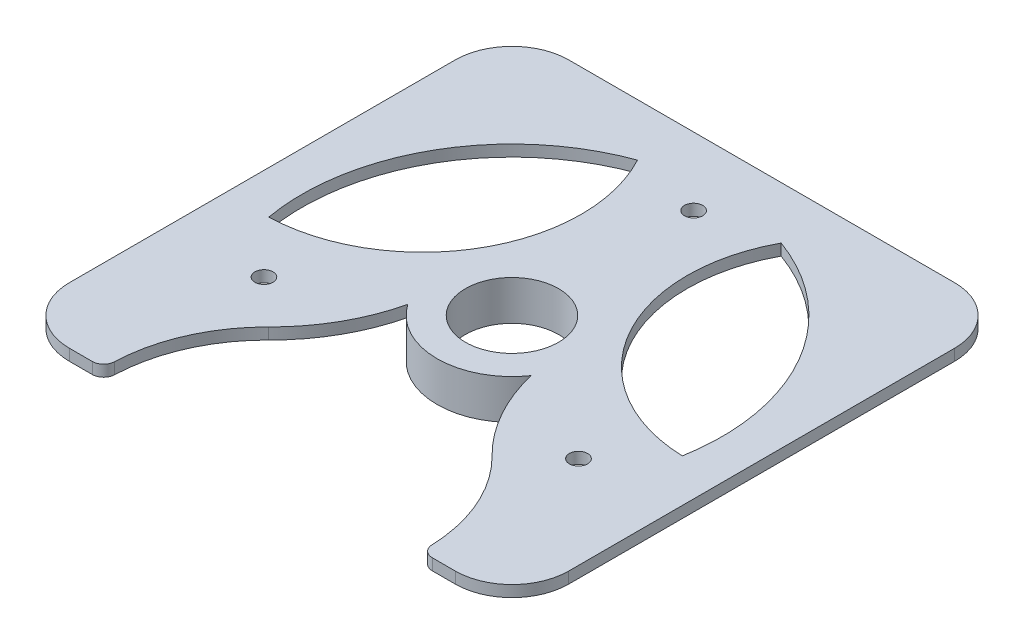
ISO-10303-21;
HEADER;
FILE_DESCRIPTION(('STEP AP214'),'2;1');
FILE_NAME('part.step','',(''),(''),'','','');
FILE_SCHEMA(('AUTOMOTIVE_DESIGN { 1 0 10303 214 1 1 1 1 }'));
ENDSEC;
DATA;
#1=APPLICATION_CONTEXT('core data for automotive mechanical design processes');
#2=APPLICATION_PROTOCOL_DEFINITION('international standard','automotive_design',2000,#1);
#3=PRODUCT_CONTEXT('',#1,'mechanical');
#4=PRODUCT('Part','Part','',(#3));
#5=PRODUCT_RELATED_PRODUCT_CATEGORY('part','',(#4));
#6=PRODUCT_DEFINITION_FORMATION('','',#4);
#7=PRODUCT_DEFINITION_CONTEXT('part definition',#1,'design');
#8=PRODUCT_DEFINITION('design','',#6,#7);
#9=PRODUCT_DEFINITION_SHAPE('','',#8);
#10=(LENGTH_UNIT() NAMED_UNIT(*) SI_UNIT(.MILLI.,.METRE.));
#11=(NAMED_UNIT(*) PLANE_ANGLE_UNIT() SI_UNIT($,.RADIAN.));
#12=(NAMED_UNIT(*) SI_UNIT($,.STERADIAN.) SOLID_ANGLE_UNIT());
#13=UNCERTAINTY_MEASURE_WITH_UNIT(LENGTH_MEASURE(1.E-05),#10,'distance_accuracy_value','');
#14=(GEOMETRIC_REPRESENTATION_CONTEXT(3) GLOBAL_UNCERTAINTY_ASSIGNED_CONTEXT((#13)) GLOBAL_UNIT_ASSIGNED_CONTEXT((#10,
#11,#12)) REPRESENTATION_CONTEXT('',''));
#15=CARTESIAN_POINT('',(0.,0.,0.));
#16=DIRECTION('',(0.,0.,1.));
#17=DIRECTION('',(1.,0.,0.));
#18=AXIS2_PLACEMENT_3D('',#15,#16,#17);
#19=CARTESIAN_POINT('',(0.,2.,0.));
#20=DIRECTION('',(0.,-1.,0.));
#21=DIRECTION('',(0.,0.,-1.));
#22=AXIS2_PLACEMENT_3D('',#19,#20,#21);
#23=PLANE('',#22);
#24=CARTESIAN_POINT('',(27.712812921102,2.,16.0000000000001));
#25=DIRECTION('',(0.,-1.,0.));
#26=DIRECTION('',(0.866025403784436,0.,0.500000000000004));
#27=AXIS2_PLACEMENT_3D('',#24,#25,#26);
#28=CIRCLE('',#27,1.6);
#29=CARTESIAN_POINT('',(29.0984535671571,2.,16.8000000000001));
#30=VERTEX_POINT('',#29);
#31=EDGE_CURVE('E695',#30,#30,#28,.T.);
#32=ORIENTED_EDGE('',*,*,#31,.T.);
#33=EDGE_LOOP('',(#32));
#34=FACE_BOUND('',#33,.T.);
#35=CARTESIAN_POINT('',(-27.7128129211022,2.,15.9999999999997));
#36=DIRECTION('',(0.,-1.,0.));
#37=DIRECTION('',(-0.866025403784443,0.,0.499999999999992));
#38=AXIS2_PLACEMENT_3D('',#35,#36,#37);
#39=CIRCLE('',#38,1.6);
#40=CARTESIAN_POINT('',(-29.0984535671573,2.,16.7999999999997));
#41=VERTEX_POINT('',#40);
#42=EDGE_CURVE('E699',#41,#41,#39,.T.);
#43=ORIENTED_EDGE('',*,*,#42,.T.);
#44=EDGE_LOOP('',(#43));
#45=FACE_BOUND('',#44,.T.);
#46=CARTESIAN_POINT('',(0.,2.,-32.));
#47=DIRECTION('',(0.,-1.,0.));
#48=DIRECTION('',(0.,0.,-1.));
#49=AXIS2_PLACEMENT_3D('',#46,#47,#48);
#50=CIRCLE('',#49,1.6);
#51=CARTESIAN_POINT('',(0.,2.,-33.6));
#52=VERTEX_POINT('',#51);
#53=EDGE_CURVE('E709',#52,#52,#50,.T.);
#54=ORIENTED_EDGE('',*,*,#53,.T.);
#55=EDGE_LOOP('',(#54));
#56=FACE_BOUND('',#55,.T.);
#57=CARTESIAN_POINT('',(-37.3070238699556,2.,-21.5392202739826));
#58=DIRECTION('',(0.,1.,0.));
#59=DIRECTION('',(0.866025403784436,0.,-0.500000000000004));
#60=AXIS2_PLACEMENT_3D('',#57,#58,#59);
#61=CIRCLE('',#60,27.9777061254953);
#62=CARTESIAN_POINT('',(-36.4378868614517,2.,6.42498257367656));
#63=VERTEX_POINT('',#62);
#64=CARTESIAN_POINT('',(-12.6547453030497,2.,-34.7686269690786));
#65=VERTEX_POINT('',#64);
#66=EDGE_CURVE('E414',#63,#65,#61,.T.);
#67=ORIENTED_EDGE('',*,*,#66,.F.);
#68=CARTESIAN_POINT('',(0.,2.,0.));
#69=DIRECTION('',(0.,1.,0.));
#70=DIRECTION('',(0.866025403784436,0.,-0.500000000000004));
#71=AXIS2_PLACEMENT_3D('',#68,#69,#70);
#72=CIRCLE('',#71,37.);
#73=EDGE_CURVE('E197',#65,#63,#72,.T.);
#74=ORIENTED_EDGE('',*,*,#73,.F.);
#75=EDGE_LOOP('',(#67,#74));
#76=FACE_BOUND('',#75,.T.);
#77=CARTESIAN_POINT('',(37.3070238699556,2.,-21.5392202739825));
#78=DIRECTION('',(0.,1.,0.));
#79=DIRECTION('',(0.,0.,1.));
#80=AXIS2_PLACEMENT_3D('',#77,#78,#79);
#81=CIRCLE('',#80,27.9777061254953);
#82=CARTESIAN_POINT('',(12.6547453030498,2.,-34.7686269690786));
#83=VERTEX_POINT('',#82);
#84=CARTESIAN_POINT('',(36.4378868614517,2.,6.42498257367663));
#85=VERTEX_POINT('',#84);
#86=EDGE_CURVE('E208',#83,#85,#81,.T.);
#87=ORIENTED_EDGE('',*,*,#86,.F.);
#88=CARTESIAN_POINT('',(0.,2.,0.));
#89=DIRECTION('',(0.,1.,0.));
#90=DIRECTION('',(0.,0.,1.));
#91=AXIS2_PLACEMENT_3D('',#88,#89,#90);
#92=CIRCLE('',#91,37.);
#93=EDGE_CURVE('E212',#85,#83,#92,.T.);
#94=ORIENTED_EDGE('',*,*,#93,.F.);
#95=EDGE_LOOP('',(#87,#94));
#96=FACE_BOUND('',#95,.T.);
#97=CARTESIAN_POINT('',(-42.6237394195835,2.,0.));
#98=DIRECTION('',(0.,-1.,0.));
#99=DIRECTION('',(0.,0.,-1.));
#100=AXIS2_PLACEMENT_3D('',#97,#98,#99);
#101=CIRCLE('',#100,32.6237394195835);
#102=CARTESIAN_POINT('',(-10.8708761949437,2.,7.48759312157157));
#103=VERTEX_POINT('',#102);
#104=CARTESIAN_POINT('',(-19.6779869642504,2.,23.1905329385821));
#105=VERTEX_POINT('',#104);
#106=EDGE_CURVE('E186',#103,#105,#101,.T.);
#107=ORIENTED_EDGE('',*,*,#106,.F.);
#108=CARTESIAN_POINT('',(0.,2.,0.));
#109=DIRECTION('',(0.,-1.,0.));
#110=DIRECTION('',(0.,0.,-1.));
#111=AXIS2_PLACEMENT_3D('',#108,#109,#110);
#112=CIRCLE('',#111,13.2);
#113=CARTESIAN_POINT('',(10.8708761949437,2.,7.48759312157157));
#114=VERTEX_POINT('',#113);
#115=EDGE_CURVE('E402',#103,#114,#112,.F.);
#116=ORIENTED_EDGE('',*,*,#115,.T.);
#117=CARTESIAN_POINT('',(42.6237394195835,2.,0.));
#118=DIRECTION('',(0.,-1.,0.));
#119=DIRECTION('',(0.,0.,1.));
#120=AXIS2_PLACEMENT_3D('',#117,#118,#119);
#121=CIRCLE('',#120,32.6237394195835);
#122=CARTESIAN_POINT('',(19.6779869642505,2.,23.190532938582));
#123=VERTEX_POINT('',#122);
#124=EDGE_CURVE('E181',#123,#114,#121,.T.);
#125=ORIENTED_EDGE('',*,*,#124,.F.);
#126=CARTESIAN_POINT('',(2.63677968348475E-13,2.,43.0784405479653));
#127=DIRECTION('',(0.,1.,0.));
#128=DIRECTION('',(-0.866025403784443,0.,-0.499999999999992));
#129=AXIS2_PLACEMENT_3D('',#126,#127,#128);
#130=CIRCLE('',#129,27.9777061254953);
#131=CARTESIAN_POINT('',(27.9595961312682,2.,42.071949504305));
#132=VERTEX_POINT('',#131);
#133=EDGE_CURVE('E195',#132,#123,#130,.T.);
#134=ORIENTED_EDGE('',*,*,#133,.F.);
#135=CARTESIAN_POINT('',(29.9583015294773,2.,42.));
#136=DIRECTION('',(0.,-1.,0.));
#137=DIRECTION('',(0.,0.,-1.));
#138=AXIS2_PLACEMENT_3D('',#135,#136,#137);
#139=CIRCLE('',#138,2.);
#140=CARTESIAN_POINT('',(29.9583015294773,2.,44.));
#141=VERTEX_POINT('',#140);
#142=EDGE_CURVE('E296',#132,#141,#139,.F.);
#143=ORIENTED_EDGE('',*,*,#142,.T.);
#144=DIRECTION('',(1.,0.,0.));
#145=VECTOR('',#144,1.);
#146=CARTESIAN_POINT('',(-44.,2.,44.));
#147=LINE('',#146,#145);
#148=CARTESIAN_POINT('',(34.,2.,44.));
#149=VERTEX_POINT('',#148);
#150=EDGE_CURVE('E232',#141,#149,#147,.T.);
#151=ORIENTED_EDGE('',*,*,#150,.T.);
#152=CARTESIAN_POINT('',(34.,2.,34.));
#153=DIRECTION('',(0.,-1.,0.));
#154=DIRECTION('',(0.,0.,-1.));
#155=AXIS2_PLACEMENT_3D('',#152,#153,#154);
#156=CIRCLE('',#155,10.);
#157=CARTESIAN_POINT('',(44.,2.,34.));
#158=VERTEX_POINT('',#157);
#159=EDGE_CURVE('E273',#149,#158,#156,.F.);
#160=ORIENTED_EDGE('',*,*,#159,.T.);
#161=DIRECTION('',(0.,0.,-1.));
#162=VECTOR('',#161,1.);
#163=CARTESIAN_POINT('',(44.,2.,44.));
#164=LINE('',#163,#162);
#165=CARTESIAN_POINT('',(44.,2.,-34.));
#166=VERTEX_POINT('',#165);
#167=EDGE_CURVE('E222',#158,#166,#164,.T.);
#168=ORIENTED_EDGE('',*,*,#167,.T.);
#169=CARTESIAN_POINT('',(34.,2.,-34.));
#170=DIRECTION('',(0.,-1.,0.));
#171=DIRECTION('',(0.,0.,-1.));
#172=AXIS2_PLACEMENT_3D('',#169,#170,#171);
#173=CIRCLE('',#172,10.);
#174=CARTESIAN_POINT('',(34.,2.,-44.));
#175=VERTEX_POINT('',#174);
#176=EDGE_CURVE('E269',#166,#175,#173,.F.);
#177=ORIENTED_EDGE('',*,*,#176,.T.);
#178=DIRECTION('',(-1.,0.,0.));
#179=VECTOR('',#178,1.);
#180=CARTESIAN_POINT('',(-44.,2.,-44.));
#181=LINE('',#180,#179);
#182=CARTESIAN_POINT('',(-34.,2.,-44.));
#183=VERTEX_POINT('',#182);
#184=EDGE_CURVE('E225',#175,#183,#181,.T.);
#185=ORIENTED_EDGE('',*,*,#184,.T.);
#186=CARTESIAN_POINT('',(-34.,2.,-34.));
#187=DIRECTION('',(0.,-1.,0.));
#188=DIRECTION('',(0.,0.,-1.));
#189=AXIS2_PLACEMENT_3D('',#186,#187,#188);
#190=CIRCLE('',#189,10.);
#191=CARTESIAN_POINT('',(-44.,2.,-34.));
#192=VERTEX_POINT('',#191);
#193=EDGE_CURVE('E267',#183,#192,#190,.F.);
#194=ORIENTED_EDGE('',*,*,#193,.T.);
#195=DIRECTION('',(0.,0.,1.));
#196=VECTOR('',#195,1.);
#197=CARTESIAN_POINT('',(-44.,2.,44.));
#198=LINE('',#197,#196);
#199=CARTESIAN_POINT('',(-44.,2.,34.));
#200=VERTEX_POINT('',#199);
#201=EDGE_CURVE('E229',#192,#200,#198,.T.);
#202=ORIENTED_EDGE('',*,*,#201,.T.);
#203=CARTESIAN_POINT('',(-34.,2.,34.));
#204=DIRECTION('',(0.,-1.,0.));
#205=DIRECTION('',(0.,0.,-1.));
#206=AXIS2_PLACEMENT_3D('',#203,#204,#205);
#207=CIRCLE('',#206,10.);
#208=CARTESIAN_POINT('',(-34.,2.,44.));
#209=VERTEX_POINT('',#208);
#210=EDGE_CURVE('E271',#200,#209,#207,.F.);
#211=ORIENTED_EDGE('',*,*,#210,.T.);
#212=CARTESIAN_POINT('',(-29.9583015294768,2.,44.));
#213=VERTEX_POINT('',#212);
#214=EDGE_CURVE('E233',#209,#213,#147,.T.);
#215=ORIENTED_EDGE('',*,*,#214,.T.);
#216=CARTESIAN_POINT('',(-29.9583015294768,2.,42.));
#217=DIRECTION('',(0.,-1.,0.));
#218=DIRECTION('',(0.,0.,-1.));
#219=AXIS2_PLACEMENT_3D('',#216,#217,#218);
#220=CIRCLE('',#219,2.);
#221=CARTESIAN_POINT('',(-27.9595961312676,2.,42.071949504305));
#222=VERTEX_POINT('',#221);
#223=EDGE_CURVE('E294',#213,#222,#220,.F.);
#224=ORIENTED_EDGE('',*,*,#223,.T.);
#225=EDGE_CURVE('E198',#105,#222,#130,.T.);
#226=ORIENTED_EDGE('',*,*,#225,.F.);
#227=EDGE_LOOP('',(#107,#116,#125,#134,#143,#151,#160,#168,#177,#185,#194,#202,#211,#215,#224,#226));
#228=FACE_BOUND('',#227,.T.);
#229=CARTESIAN_POINT('',(0.,2.,0.));
#230=DIRECTION('',(0.,-1.,0.));
#231=DIRECTION('',(0.,0.,-1.));
#232=AXIS2_PLACEMENT_3D('',#229,#230,#231);
#233=CIRCLE('',#232,8.2);
#234=CARTESIAN_POINT('',(0.,2.,-8.2));
#235=VERTEX_POINT('',#234);
#236=EDGE_CURVE('E720',#235,#235,#233,.F.);
#237=ORIENTED_EDGE('',*,*,#236,.F.);
#238=EDGE_LOOP('',(#237));
#239=FACE_BOUND('',#238,.T.);
#240=ADVANCED_FACE('F38',(#34,#45,#56,#76,#96,#228,#239),#23,.F.);
#241=CARTESIAN_POINT('',(0.,0.,0.));
#242=DIRECTION('',(0.,-1.,0.));
#243=DIRECTION('',(0.,0.,-1.));
#244=AXIS2_PLACEMENT_3D('',#241,#242,#243);
#245=PLANE('',#244);
#246=CARTESIAN_POINT('',(27.712812921102,0.,16.0000000000001));
#247=DIRECTION('',(0.,-1.,0.));
#248=DIRECTION('',(0.866025403784436,0.,0.500000000000004));
#249=AXIS2_PLACEMENT_3D('',#246,#247,#248);
#250=CIRCLE('',#249,1.6);
#251=CARTESIAN_POINT('',(29.0984535671571,0.,16.8000000000001));
#252=VERTEX_POINT('',#251);
#253=EDGE_CURVE('E698',#252,#252,#250,.T.);
#254=ORIENTED_EDGE('',*,*,#253,.F.);
#255=EDGE_LOOP('',(#254));
#256=FACE_BOUND('',#255,.T.);
#257=CARTESIAN_POINT('',(-27.7128129211022,0.,15.9999999999997));
#258=DIRECTION('',(0.,-1.,0.));
#259=DIRECTION('',(-0.866025403784443,0.,0.499999999999992));
#260=AXIS2_PLACEMENT_3D('',#257,#258,#259);
#261=CIRCLE('',#260,1.6);
#262=CARTESIAN_POINT('',(-29.0984535671573,0.,16.7999999999997));
#263=VERTEX_POINT('',#262);
#264=EDGE_CURVE('E704',#263,#263,#261,.T.);
#265=ORIENTED_EDGE('',*,*,#264,.F.);
#266=EDGE_LOOP('',(#265));
#267=FACE_BOUND('',#266,.T.);
#268=CARTESIAN_POINT('',(0.,0.,-32.));
#269=DIRECTION('',(0.,-1.,0.));
#270=DIRECTION('',(0.,0.,-1.));
#271=AXIS2_PLACEMENT_3D('',#268,#269,#270);
#272=CIRCLE('',#271,1.6);
#273=CARTESIAN_POINT('',(0.,0.,-33.6));
#274=VERTEX_POINT('',#273);
#275=EDGE_CURVE('E701',#274,#274,#272,.T.);
#276=ORIENTED_EDGE('',*,*,#275,.F.);
#277=EDGE_LOOP('',(#276));
#278=FACE_BOUND('',#277,.T.);
#279=CARTESIAN_POINT('',(0.,0.,0.));
#280=DIRECTION('',(0.,-1.,0.));
#281=DIRECTION('',(0.,0.,-1.));
#282=AXIS2_PLACEMENT_3D('',#279,#280,#281);
#283=CIRCLE('',#282,13.2);
#284=CARTESIAN_POINT('',(-10.8708761949437,0.,7.48759312157157));
#285=VERTEX_POINT('',#284);
#286=CARTESIAN_POINT('',(10.8708761949437,0.,7.48759312157157));
#287=VERTEX_POINT('',#286);
#288=EDGE_CURVE('E53',#285,#287,#283,.T.);
#289=ORIENTED_EDGE('',*,*,#288,.F.);
#290=CARTESIAN_POINT('',(-42.6237394195835,0.,0.));
#291=DIRECTION('',(0.,-1.,0.));
#292=DIRECTION('',(0.,0.,-1.));
#293=AXIS2_PLACEMENT_3D('',#290,#291,#292);
#294=CIRCLE('',#293,32.6237394195835);
#295=CARTESIAN_POINT('',(-19.6779869642504,0.,23.1905329385821));
#296=VERTEX_POINT('',#295);
#297=EDGE_CURVE('E173',#285,#296,#294,.T.);
#298=ORIENTED_EDGE('',*,*,#297,.T.);
#299=CARTESIAN_POINT('',(2.63677968348475E-13,0.,43.0784405479653));
#300=DIRECTION('',(0.,1.,0.));
#301=DIRECTION('',(-0.866025403784443,0.,-0.499999999999992));
#302=AXIS2_PLACEMENT_3D('',#299,#300,#301);
#303=CIRCLE('',#302,27.9777061254953);
#304=CARTESIAN_POINT('',(-27.9595961312676,0.,42.071949504305));
#305=VERTEX_POINT('',#304);
#306=EDGE_CURVE('E178',#296,#305,#303,.T.);
#307=ORIENTED_EDGE('',*,*,#306,.T.);
#308=CARTESIAN_POINT('',(-29.9583015294768,0.,42.));
#309=DIRECTION('',(0.,-1.,0.));
#310=DIRECTION('',(0.,0.,-1.));
#311=AXIS2_PLACEMENT_3D('',#308,#309,#310);
#312=CIRCLE('',#311,2.);
#313=CARTESIAN_POINT('',(-29.9583015294768,0.,44.));
#314=VERTEX_POINT('',#313);
#315=EDGE_CURVE('E288',#305,#314,#312,.T.);
#316=ORIENTED_EDGE('',*,*,#315,.T.);
#317=DIRECTION('',(1.,0.,0.));
#318=VECTOR('',#317,1.);
#319=CARTESIAN_POINT('',(-44.,0.,44.));
#320=LINE('',#319,#318);
#321=CARTESIAN_POINT('',(-34.,0.,44.));
#322=VERTEX_POINT('',#321);
#323=EDGE_CURVE('E226',#322,#314,#320,.T.);
#324=ORIENTED_EDGE('',*,*,#323,.F.);
#325=CARTESIAN_POINT('',(-34.,0.,34.));
#326=DIRECTION('',(0.,-1.,0.));
#327=DIRECTION('',(0.,0.,-1.));
#328=AXIS2_PLACEMENT_3D('',#325,#326,#327);
#329=CIRCLE('',#328,10.);
#330=CARTESIAN_POINT('',(-44.,0.,34.));
#331=VERTEX_POINT('',#330);
#332=EDGE_CURVE('E256',#322,#331,#329,.T.);
#333=ORIENTED_EDGE('',*,*,#332,.T.);
#334=DIRECTION('',(0.,0.,1.));
#335=VECTOR('',#334,1.);
#336=CARTESIAN_POINT('',(-44.,0.,44.));
#337=LINE('',#336,#335);
#338=CARTESIAN_POINT('',(-44.,0.,-34.));
#339=VERTEX_POINT('',#338);
#340=EDGE_CURVE('E242',#339,#331,#337,.T.);
#341=ORIENTED_EDGE('',*,*,#340,.F.);
#342=CARTESIAN_POINT('',(-34.,0.,-34.));
#343=DIRECTION('',(0.,-1.,0.));
#344=DIRECTION('',(0.,0.,-1.));
#345=AXIS2_PLACEMENT_3D('',#342,#343,#344);
#346=CIRCLE('',#345,10.);
#347=CARTESIAN_POINT('',(-34.,0.,-44.));
#348=VERTEX_POINT('',#347);
#349=EDGE_CURVE('E252',#339,#348,#346,.T.);
#350=ORIENTED_EDGE('',*,*,#349,.T.);
#351=DIRECTION('',(-1.,0.,0.));
#352=VECTOR('',#351,1.);
#353=CARTESIAN_POINT('',(-44.,0.,-44.));
#354=LINE('',#353,#352);
#355=CARTESIAN_POINT('',(34.,0.,-44.));
#356=VERTEX_POINT('',#355);
#357=EDGE_CURVE('E239',#356,#348,#354,.T.);
#358=ORIENTED_EDGE('',*,*,#357,.F.);
#359=CARTESIAN_POINT('',(34.,0.,-34.));
#360=DIRECTION('',(0.,-1.,0.));
#361=DIRECTION('',(0.,0.,-1.));
#362=AXIS2_PLACEMENT_3D('',#359,#360,#361);
#363=CIRCLE('',#362,10.);
#364=CARTESIAN_POINT('',(44.,0.,-34.));
#365=VERTEX_POINT('',#364);
#366=EDGE_CURVE('E254',#356,#365,#363,.T.);
#367=ORIENTED_EDGE('',*,*,#366,.T.);
#368=DIRECTION('',(0.,0.,-1.));
#369=VECTOR('',#368,1.);
#370=CARTESIAN_POINT('',(44.,0.,44.));
#371=LINE('',#370,#369);
#372=CARTESIAN_POINT('',(44.,0.,34.));
#373=VERTEX_POINT('',#372);
#374=EDGE_CURVE('E219',#373,#365,#371,.T.);
#375=ORIENTED_EDGE('',*,*,#374,.F.);
#376=CARTESIAN_POINT('',(34.,0.,34.));
#377=DIRECTION('',(0.,-1.,0.));
#378=DIRECTION('',(0.,0.,-1.));
#379=AXIS2_PLACEMENT_3D('',#376,#377,#378);
#380=CIRCLE('',#379,10.);
#381=CARTESIAN_POINT('',(34.,0.,44.));
#382=VERTEX_POINT('',#381);
#383=EDGE_CURVE('E258',#373,#382,#380,.T.);
#384=ORIENTED_EDGE('',*,*,#383,.T.);
#385=CARTESIAN_POINT('',(29.9583015294773,0.,44.));
#386=VERTEX_POINT('',#385);
#387=EDGE_CURVE('E245',#386,#382,#320,.T.);
#388=ORIENTED_EDGE('',*,*,#387,.F.);
#389=CARTESIAN_POINT('',(29.9583015294773,0.,42.));
#390=DIRECTION('',(0.,-1.,0.));
#391=DIRECTION('',(0.,0.,-1.));
#392=AXIS2_PLACEMENT_3D('',#389,#390,#391);
#393=CIRCLE('',#392,2.);
#394=CARTESIAN_POINT('',(27.9595961312682,0.,42.071949504305));
#395=VERTEX_POINT('',#394);
#396=EDGE_CURVE('E290',#386,#395,#393,.T.);
#397=ORIENTED_EDGE('',*,*,#396,.T.);
#398=CARTESIAN_POINT('',(19.6779869642508,0.,23.190532938582));
#399=VERTEX_POINT('',#398);
#400=EDGE_CURVE('E194',#395,#399,#303,.T.);
#401=ORIENTED_EDGE('',*,*,#400,.T.);
#402=CARTESIAN_POINT('',(42.6237394195835,0.,0.));
#403=DIRECTION('',(0.,-1.,0.));
#404=DIRECTION('',(0.,0.,1.));
#405=AXIS2_PLACEMENT_3D('',#402,#403,#404);
#406=CIRCLE('',#405,32.6237394195835);
#407=EDGE_CURVE('E180',#399,#287,#406,.T.);
#408=ORIENTED_EDGE('',*,*,#407,.T.);
#409=EDGE_LOOP('',(#289,#298,#307,#316,#324,#333,#341,#350,#358,#367,#375,#384,#388,#397,#401,#408));
#410=FACE_BOUND('',#409,.T.);
#411=CARTESIAN_POINT('',(0.,0.,0.));
#412=DIRECTION('',(0.,1.,0.));
#413=DIRECTION('',(0.,0.,1.));
#414=AXIS2_PLACEMENT_3D('',#411,#412,#413);
#415=CIRCLE('',#414,37.);
#416=CARTESIAN_POINT('',(36.4378868614517,0.,6.42498257367663));
#417=VERTEX_POINT('',#416);
#418=CARTESIAN_POINT('',(12.6547453030498,0.,-34.7686269690786));
#419=VERTEX_POINT('',#418);
#420=EDGE_CURVE('E204',#417,#419,#415,.T.);
#421=ORIENTED_EDGE('',*,*,#420,.T.);
#422=CARTESIAN_POINT('',(37.3070238699556,0.,-21.5392202739825));
#423=DIRECTION('',(0.,1.,0.));
#424=DIRECTION('',(0.,0.,1.));
#425=AXIS2_PLACEMENT_3D('',#422,#423,#424);
#426=CIRCLE('',#425,27.9777061254953);
#427=EDGE_CURVE('E207',#419,#417,#426,.T.);
#428=ORIENTED_EDGE('',*,*,#427,.T.);
#429=EDGE_LOOP('',(#421,#428));
#430=FACE_BOUND('',#429,.T.);
#431=CARTESIAN_POINT('',(0.,0.,0.));
#432=DIRECTION('',(0.,1.,0.));
#433=DIRECTION('',(0.866025403784436,0.,-0.500000000000004));
#434=AXIS2_PLACEMENT_3D('',#431,#432,#433);
#435=CIRCLE('',#434,37.);
#436=CARTESIAN_POINT('',(-12.6547453030497,0.,-34.7686269690786));
#437=VERTEX_POINT('',#436);
#438=CARTESIAN_POINT('',(-36.4378868614517,0.,6.42498257367656));
#439=VERTEX_POINT('',#438);
#440=EDGE_CURVE('E410',#437,#439,#435,.T.);
#441=ORIENTED_EDGE('',*,*,#440,.T.);
#442=CARTESIAN_POINT('',(-37.3070238699556,0.,-21.5392202739826));
#443=DIRECTION('',(0.,1.,0.));
#444=DIRECTION('',(0.866025403784436,0.,-0.500000000000004));
#445=AXIS2_PLACEMENT_3D('',#442,#443,#444);
#446=CIRCLE('',#445,27.9777061254953);
#447=EDGE_CURVE('E413',#439,#437,#446,.T.);
#448=ORIENTED_EDGE('',*,*,#447,.T.);
#449=EDGE_LOOP('',(#441,#448));
#450=FACE_BOUND('',#449,.T.);
#451=ADVANCED_FACE('F175',(#256,#267,#278,#410,#430,#450),#245,.T.);
#452=CARTESIAN_POINT('',(2.63677968348475E-13,0.,43.0784405479653));
#453=DIRECTION('',(0.,1.,0.));
#454=DIRECTION('',(0.,0.,1.));
#455=AXIS2_PLACEMENT_3D('',#452,#453,#454);
#456=CYLINDRICAL_SURFACE('',#455,27.9777061254953);
#457=ORIENTED_EDGE('',*,*,#400,.F.);
#458=DIRECTION('',(0.,1.,0.));
#459=VECTOR('',#458,1.);
#460=CARTESIAN_POINT('',(27.9595961312682,0.,42.071949504305));
#461=LINE('',#460,#459);
#462=EDGE_CURVE('E292',#395,#132,#461,.T.);
#463=ORIENTED_EDGE('',*,*,#462,.T.);
#464=ORIENTED_EDGE('',*,*,#133,.T.);
#465=DIRECTION('',(0.,1.,0.));
#466=VECTOR('',#465,1.);
#467=CARTESIAN_POINT('',(19.6779869642505,0.,23.190532938582));
#468=LINE('',#467,#466);
#469=EDGE_CURVE('E190',#399,#123,#468,.T.);
#470=ORIENTED_EDGE('',*,*,#469,.F.);
#471=EDGE_LOOP('',(#457,#463,#464,#470));
#472=FACE_BOUND('',#471,.T.);
#473=ADVANCED_FACE('F333',(#472),#456,.F.);
#474=CARTESIAN_POINT('',(-44.,2.,44.));
#475=DIRECTION('',(0.,0.,-1.));
#476=DIRECTION('',(-1.,0.,0.));
#477=AXIS2_PLACEMENT_3D('',#474,#475,#476);
#478=PLANE('',#477);
#479=ORIENTED_EDGE('',*,*,#323,.T.);
#480=DIRECTION('',(0.,1.,0.));
#481=VECTOR('',#480,1.);
#482=CARTESIAN_POINT('',(-29.9583015294768,2.,44.));
#483=LINE('',#482,#481);
#484=EDGE_CURVE('E298',#314,#213,#483,.T.);
#485=ORIENTED_EDGE('',*,*,#484,.T.);
#486=ORIENTED_EDGE('',*,*,#214,.F.);
#487=DIRECTION('',(0.,-1.,0.));
#488=VECTOR('',#487,1.);
#489=CARTESIAN_POINT('',(-34.,2.,44.));
#490=LINE('',#489,#488);
#491=EDGE_CURVE('E261',#209,#322,#490,.T.);
#492=ORIENTED_EDGE('',*,*,#491,.T.);
#493=EDGE_LOOP('',(#479,#485,#486,#492));
#494=FACE_BOUND('',#493,.T.);
#495=ADVANCED_FACE('F303',(#494),#478,.F.);
#496=CARTESIAN_POINT('',(44.,2.,44.));
#497=DIRECTION('',(-1.,0.,0.));
#498=DIRECTION('',(0.,0.,1.));
#499=AXIS2_PLACEMENT_3D('',#496,#497,#498);
#500=PLANE('',#499);
#501=ORIENTED_EDGE('',*,*,#167,.F.);
#502=DIRECTION('',(0.,-1.,0.));
#503=VECTOR('',#502,1.);
#504=CARTESIAN_POINT('',(44.,2.,34.));
#505=LINE('',#504,#503);
#506=EDGE_CURVE('E249',#158,#373,#505,.T.);
#507=ORIENTED_EDGE('',*,*,#506,.T.);
#508=ORIENTED_EDGE('',*,*,#374,.T.);
#509=DIRECTION('',(0.,-1.,0.));
#510=VECTOR('',#509,1.);
#511=CARTESIAN_POINT('',(44.,2.,-34.));
#512=LINE('',#511,#510);
#513=EDGE_CURVE('E236',#365,#166,#512,.F.);
#514=ORIENTED_EDGE('',*,*,#513,.T.);
#515=EDGE_LOOP('',(#501,#507,#508,#514));
#516=FACE_BOUND('',#515,.T.);
#517=ADVANCED_FACE('F354',(#516),#500,.F.);
#518=CARTESIAN_POINT('',(-44.,2.,-44.));
#519=DIRECTION('',(0.,0.,1.));
#520=DIRECTION('',(1.,0.,0.));
#521=AXIS2_PLACEMENT_3D('',#518,#519,#520);
#522=PLANE('',#521);
#523=ORIENTED_EDGE('',*,*,#184,.F.);
#524=DIRECTION('',(0.,-1.,0.));
#525=VECTOR('',#524,1.);
#526=CARTESIAN_POINT('',(34.,2.,-44.));
#527=LINE('',#526,#525);
#528=EDGE_CURVE('E282',#175,#356,#527,.T.);
#529=ORIENTED_EDGE('',*,*,#528,.T.);
#530=ORIENTED_EDGE('',*,*,#357,.T.);
#531=DIRECTION('',(0.,-1.,0.));
#532=VECTOR('',#531,1.);
#533=CARTESIAN_POINT('',(-34.,2.,-44.));
#534=LINE('',#533,#532);
#535=EDGE_CURVE('E280',#348,#183,#534,.F.);
#536=ORIENTED_EDGE('',*,*,#535,.T.);
#537=EDGE_LOOP('',(#523,#529,#530,#536));
#538=FACE_BOUND('',#537,.T.);
#539=ADVANCED_FACE('F350',(#538),#522,.F.);
#540=CARTESIAN_POINT('',(-44.,2.,44.));
#541=DIRECTION('',(1.,0.,0.));
#542=DIRECTION('',(0.,0.,-1.));
#543=AXIS2_PLACEMENT_3D('',#540,#541,#542);
#544=PLANE('',#543);
#545=ORIENTED_EDGE('',*,*,#340,.T.);
#546=DIRECTION('',(0.,-1.,0.));
#547=VECTOR('',#546,1.);
#548=CARTESIAN_POINT('',(-44.,2.,34.));
#549=LINE('',#548,#547);
#550=EDGE_CURVE('E278',#331,#200,#549,.F.);
#551=ORIENTED_EDGE('',*,*,#550,.T.);
#552=ORIENTED_EDGE('',*,*,#201,.F.);
#553=DIRECTION('',(0.,-1.,0.));
#554=VECTOR('',#553,1.);
#555=CARTESIAN_POINT('',(-44.,2.,-34.));
#556=LINE('',#555,#554);
#557=EDGE_CURVE('E275',#192,#339,#556,.T.);
#558=ORIENTED_EDGE('',*,*,#557,.T.);
#559=EDGE_LOOP('',(#545,#551,#552,#558));
#560=FACE_BOUND('',#559,.T.);
#561=ADVANCED_FACE('F346',(#560),#544,.F.);
#562=ORIENTED_EDGE('',*,*,#150,.F.);
#563=DIRECTION('',(0.,1.,0.));
#564=VECTOR('',#563,1.);
#565=CARTESIAN_POINT('',(29.9583015294773,2.,44.));
#566=LINE('',#565,#564);
#567=EDGE_CURVE('E285',#141,#386,#566,.F.);
#568=ORIENTED_EDGE('',*,*,#567,.T.);
#569=ORIENTED_EDGE('',*,*,#387,.T.);
#570=DIRECTION('',(0.,-1.,0.));
#571=VECTOR('',#570,1.);
#572=CARTESIAN_POINT('',(34.,2.,44.));
#573=LINE('',#572,#571);
#574=EDGE_CURVE('E264',#382,#149,#573,.F.);
#575=ORIENTED_EDGE('',*,*,#574,.T.);
#576=EDGE_LOOP('',(#562,#568,#569,#575));
#577=FACE_BOUND('',#576,.T.);
#578=ADVANCED_FACE('F342',(#577),#478,.F.);
#579=CARTESIAN_POINT('',(34.,2.,34.));
#580=DIRECTION('',(0.,-1.,0.));
#581=DIRECTION('',(0.,0.,-1.));
#582=AXIS2_PLACEMENT_3D('',#579,#580,#581);
#583=CYLINDRICAL_SURFACE('',#582,10.);
#584=ORIENTED_EDGE('',*,*,#159,.F.);
#585=ORIENTED_EDGE('',*,*,#574,.F.);
#586=ORIENTED_EDGE('',*,*,#383,.F.);
#587=ORIENTED_EDGE('',*,*,#506,.F.);
#588=EDGE_LOOP('',(#584,#585,#586,#587));
#589=FACE_BOUND('',#588,.T.);
#590=ADVANCED_FACE('F345',(#589),#583,.T.);
#591=CARTESIAN_POINT('',(-34.,2.,34.));
#592=DIRECTION('',(0.,-1.,0.));
#593=DIRECTION('',(0.,0.,-1.));
#594=AXIS2_PLACEMENT_3D('',#591,#592,#593);
#595=CYLINDRICAL_SURFACE('',#594,10.);
#596=ORIENTED_EDGE('',*,*,#210,.F.);
#597=ORIENTED_EDGE('',*,*,#550,.F.);
#598=ORIENTED_EDGE('',*,*,#332,.F.);
#599=ORIENTED_EDGE('',*,*,#491,.F.);
#600=EDGE_LOOP('',(#596,#597,#598,#599));
#601=FACE_BOUND('',#600,.T.);
#602=ADVANCED_FACE('F313',(#601),#595,.T.);
#603=CARTESIAN_POINT('',(34.,2.,-34.));
#604=DIRECTION('',(0.,-1.,0.));
#605=DIRECTION('',(0.,0.,-1.));
#606=AXIS2_PLACEMENT_3D('',#603,#604,#605);
#607=CYLINDRICAL_SURFACE('',#606,10.);
#608=ORIENTED_EDGE('',*,*,#176,.F.);
#609=ORIENTED_EDGE('',*,*,#513,.F.);
#610=ORIENTED_EDGE('',*,*,#366,.F.);
#611=ORIENTED_EDGE('',*,*,#528,.F.);
#612=EDGE_LOOP('',(#608,#609,#610,#611));
#613=FACE_BOUND('',#612,.T.);
#614=ADVANCED_FACE('F364',(#613),#607,.T.);
#615=CARTESIAN_POINT('',(-34.,2.,-34.));
#616=DIRECTION('',(0.,-1.,0.));
#617=DIRECTION('',(0.,0.,-1.));
#618=AXIS2_PLACEMENT_3D('',#615,#616,#617);
#619=CYLINDRICAL_SURFACE('',#618,10.);
#620=ORIENTED_EDGE('',*,*,#193,.F.);
#621=ORIENTED_EDGE('',*,*,#535,.F.);
#622=ORIENTED_EDGE('',*,*,#349,.F.);
#623=ORIENTED_EDGE('',*,*,#557,.F.);
#624=EDGE_LOOP('',(#620,#621,#622,#623));
#625=FACE_BOUND('',#624,.T.);
#626=ADVANCED_FACE('F367',(#625),#619,.T.);
#627=CARTESIAN_POINT('',(0.,0.,0.));
#628=DIRECTION('',(0.,1.,0.));
#629=DIRECTION('',(0.,0.,1.));
#630=AXIS2_PLACEMENT_3D('',#627,#628,#629);
#631=CYLINDRICAL_SURFACE('',#630,37.);
#632=ORIENTED_EDGE('',*,*,#93,.T.);
#633=DIRECTION('',(0.,1.,0.));
#634=VECTOR('',#633,1.);
#635=CARTESIAN_POINT('',(12.6547453030498,0.,-34.7686269690786));
#636=LINE('',#635,#634);
#637=EDGE_CURVE('E211',#419,#83,#636,.T.);
#638=ORIENTED_EDGE('',*,*,#637,.F.);
#639=ORIENTED_EDGE('',*,*,#420,.F.);
#640=DIRECTION('',(0.,1.,0.));
#641=VECTOR('',#640,1.);
#642=CARTESIAN_POINT('',(36.4378868614517,0.,6.42498257367663));
#643=LINE('',#642,#641);
#644=EDGE_CURVE('E217',#417,#85,#643,.T.);
#645=ORIENTED_EDGE('',*,*,#644,.T.);
#646=EDGE_LOOP('',(#632,#638,#639,#645));
#647=FACE_BOUND('',#646,.T.);
#648=ADVANCED_FACE('F339',(#647),#631,.F.);
#649=CARTESIAN_POINT('',(37.3070238699556,0.,-21.5392202739825));
#650=DIRECTION('',(0.,1.,0.));
#651=DIRECTION('',(0.,0.,1.));
#652=AXIS2_PLACEMENT_3D('',#649,#650,#651);
#653=CYLINDRICAL_SURFACE('',#652,27.9777061254953);
#654=ORIENTED_EDGE('',*,*,#86,.T.);
#655=ORIENTED_EDGE('',*,*,#644,.F.);
#656=ORIENTED_EDGE('',*,*,#427,.F.);
#657=ORIENTED_EDGE('',*,*,#637,.T.);
#658=EDGE_LOOP('',(#654,#655,#656,#657));
#659=FACE_BOUND('',#658,.T.);
#660=ADVANCED_FACE('F374',(#659),#653,.F.);
#661=ORIENTED_EDGE('',*,*,#225,.T.);
#662=DIRECTION('',(0.,1.,0.));
#663=VECTOR('',#662,1.);
#664=CARTESIAN_POINT('',(-27.9595961312676,0.,42.071949504305));
#665=LINE('',#664,#663);
#666=EDGE_CURVE('E46',#222,#305,#665,.F.);
#667=ORIENTED_EDGE('',*,*,#666,.T.);
#668=ORIENTED_EDGE('',*,*,#306,.F.);
#669=DIRECTION('',(0.,1.,0.));
#670=VECTOR('',#669,1.);
#671=CARTESIAN_POINT('',(-19.6779869642504,0.,23.1905329385821));
#672=LINE('',#671,#670);
#673=EDGE_CURVE('E184',#296,#105,#672,.T.);
#674=ORIENTED_EDGE('',*,*,#673,.T.);
#675=EDGE_LOOP('',(#661,#667,#668,#674));
#676=FACE_BOUND('',#675,.T.);
#677=ADVANCED_FACE('F192',(#676),#456,.F.);
#678=CARTESIAN_POINT('',(0.,0.,0.));
#679=DIRECTION('',(0.,1.,0.));
#680=DIRECTION('',(0.,0.,1.));
#681=AXIS2_PLACEMENT_3D('',#678,#679,#680);
#682=CYLINDRICAL_SURFACE('',#681,37.);
#683=ORIENTED_EDGE('',*,*,#73,.T.);
#684=DIRECTION('',(0.,1.,0.));
#685=VECTOR('',#684,1.);
#686=CARTESIAN_POINT('',(-36.4378868614517,0.,6.42498257367656));
#687=LINE('',#686,#685);
#688=EDGE_CURVE('E201',#439,#63,#687,.T.);
#689=ORIENTED_EDGE('',*,*,#688,.F.);
#690=ORIENTED_EDGE('',*,*,#440,.F.);
#691=DIRECTION('',(0.,1.,0.));
#692=VECTOR('',#691,1.);
#693=CARTESIAN_POINT('',(-12.6547453030497,0.,-34.7686269690786));
#694=LINE('',#693,#692);
#695=EDGE_CURVE('E214',#437,#65,#694,.T.);
#696=ORIENTED_EDGE('',*,*,#695,.T.);
#697=EDGE_LOOP('',(#683,#689,#690,#696));
#698=FACE_BOUND('',#697,.T.);
#699=ADVANCED_FACE('F429',(#698),#682,.F.);
#700=CARTESIAN_POINT('',(-37.3070238699556,0.,-21.5392202739826));
#701=DIRECTION('',(0.,1.,0.));
#702=DIRECTION('',(0.,0.,1.));
#703=AXIS2_PLACEMENT_3D('',#700,#701,#702);
#704=CYLINDRICAL_SURFACE('',#703,27.9777061254953);
#705=ORIENTED_EDGE('',*,*,#66,.T.);
#706=ORIENTED_EDGE('',*,*,#695,.F.);
#707=ORIENTED_EDGE('',*,*,#447,.F.);
#708=ORIENTED_EDGE('',*,*,#688,.T.);
#709=EDGE_LOOP('',(#705,#706,#707,#708));
#710=FACE_BOUND('',#709,.T.);
#711=ADVANCED_FACE('F425',(#710),#704,.F.);
#712=CARTESIAN_POINT('',(-42.6237394195835,0.,0.));
#713=DIRECTION('',(0.,1.,0.));
#714=DIRECTION('',(0.,0.,1.));
#715=AXIS2_PLACEMENT_3D('',#712,#713,#714);
#716=CYLINDRICAL_SURFACE('',#715,32.6237394195835);
#717=ORIENTED_EDGE('',*,*,#297,.F.);
#718=DIRECTION('',(0.,-1.,0.));
#719=VECTOR('',#718,1.);
#720=CARTESIAN_POINT('',(-10.8708761949437,-1.5,7.48759312157157));
#721=LINE('',#720,#719);
#722=EDGE_CURVE('E60',#285,#103,#721,.F.);
#723=ORIENTED_EDGE('',*,*,#722,.T.);
#724=ORIENTED_EDGE('',*,*,#106,.T.);
#725=ORIENTED_EDGE('',*,*,#673,.F.);
#726=EDGE_LOOP('',(#717,#723,#724,#725));
#727=FACE_BOUND('',#726,.T.);
#728=ADVANCED_FACE('F185',(#727),#716,.T.);
#729=CARTESIAN_POINT('',(42.6237394195835,0.,0.));
#730=DIRECTION('',(0.,1.,0.));
#731=DIRECTION('',(0.,0.,1.));
#732=AXIS2_PLACEMENT_3D('',#729,#730,#731);
#733=CYLINDRICAL_SURFACE('',#732,32.6237394195835);
#734=ORIENTED_EDGE('',*,*,#124,.T.);
#735=DIRECTION('',(0.,-1.,0.));
#736=VECTOR('',#735,1.);
#737=CARTESIAN_POINT('',(10.8708761949437,-1.5,7.48759312157157));
#738=LINE('',#737,#736);
#739=EDGE_CURVE('E11',#114,#287,#738,.T.);
#740=ORIENTED_EDGE('',*,*,#739,.T.);
#741=ORIENTED_EDGE('',*,*,#407,.F.);
#742=ORIENTED_EDGE('',*,*,#469,.T.);
#743=EDGE_LOOP('',(#734,#740,#741,#742));
#744=FACE_BOUND('',#743,.T.);
#745=ADVANCED_FACE('F325',(#744),#733,.T.);
#746=CARTESIAN_POINT('',(29.9583015294773,0.,42.));
#747=DIRECTION('',(0.,1.,0.));
#748=DIRECTION('',(0.,0.,1.));
#749=AXIS2_PLACEMENT_3D('',#746,#747,#748);
#750=CYLINDRICAL_SURFACE('',#749,2.);
#751=ORIENTED_EDGE('',*,*,#142,.F.);
#752=ORIENTED_EDGE('',*,*,#462,.F.);
#753=ORIENTED_EDGE('',*,*,#396,.F.);
#754=ORIENTED_EDGE('',*,*,#567,.F.);
#755=EDGE_LOOP('',(#751,#752,#753,#754));
#756=FACE_BOUND('',#755,.T.);
#757=ADVANCED_FACE('F317',(#756),#750,.T.);
#758=CARTESIAN_POINT('',(-29.9583015294768,0.,42.));
#759=DIRECTION('',(0.,1.,0.));
#760=DIRECTION('',(0.,0.,1.));
#761=AXIS2_PLACEMENT_3D('',#758,#759,#760);
#762=CYLINDRICAL_SURFACE('',#761,2.);
#763=ORIENTED_EDGE('',*,*,#315,.F.);
#764=ORIENTED_EDGE('',*,*,#666,.F.);
#765=ORIENTED_EDGE('',*,*,#223,.F.);
#766=ORIENTED_EDGE('',*,*,#484,.F.);
#767=EDGE_LOOP('',(#763,#764,#765,#766));
#768=FACE_BOUND('',#767,.T.);
#769=ADVANCED_FACE('F40',(#768),#762,.T.);
#770=CARTESIAN_POINT('',(0.,39.3352380466497,0.));
#771=DIRECTION('',(0.,-1.,0.));
#772=DIRECTION('',(0.,0.,-1.));
#773=AXIS2_PLACEMENT_3D('',#770,#771,#772);
#774=CYLINDRICAL_SURFACE('',#773,13.2);
#775=CARTESIAN_POINT('',(0.,-5.,0.));
#776=DIRECTION('',(0.,-1.,0.));
#777=DIRECTION('',(0.,0.,-1.));
#778=AXIS2_PLACEMENT_3D('',#775,#776,#777);
#779=CIRCLE('',#778,13.2);
#780=CARTESIAN_POINT('',(0.,-5.,-13.2));
#781=VERTEX_POINT('',#780);
#782=EDGE_CURVE('E717',#781,#781,#779,.T.);
#783=ORIENTED_EDGE('',*,*,#782,.F.);
#784=EDGE_LOOP('',(#783));
#785=FACE_BOUND('',#784,.T.);
#786=ORIENTED_EDGE('',*,*,#722,.F.);
#787=ORIENTED_EDGE('',*,*,#288,.T.);
#788=ORIENTED_EDGE('',*,*,#739,.F.);
#789=ORIENTED_EDGE('',*,*,#115,.F.);
#790=EDGE_LOOP('',(#786,#787,#788,#789));
#791=FACE_BOUND('',#790,.T.);
#792=ADVANCED_FACE('F316',(#785,#791),#774,.T.);
#793=CARTESIAN_POINT('',(0.,39.3352380466497,0.));
#794=DIRECTION('',(0.,-1.,0.));
#795=DIRECTION('',(0.,0.,-1.));
#796=AXIS2_PLACEMENT_3D('',#793,#794,#795);
#797=CYLINDRICAL_SURFACE('',#796,8.2);
#798=ORIENTED_EDGE('',*,*,#236,.T.);
#799=EDGE_LOOP('',(#798));
#800=FACE_BOUND('',#799,.T.);
#801=CARTESIAN_POINT('',(0.,-5.,0.));
#802=DIRECTION('',(0.,-1.,0.));
#803=DIRECTION('',(0.,0.,-1.));
#804=AXIS2_PLACEMENT_3D('',#801,#802,#803);
#805=CIRCLE('',#804,8.2);
#806=CARTESIAN_POINT('',(0.,-5.,-8.2));
#807=VERTEX_POINT('',#806);
#808=EDGE_CURVE('E712',#807,#807,#805,.T.);
#809=ORIENTED_EDGE('',*,*,#808,.T.);
#810=EDGE_LOOP('',(#809));
#811=FACE_BOUND('',#810,.T.);
#812=ADVANCED_FACE('F322',(#800,#811),#797,.F.);
#813=CARTESIAN_POINT('',(0.,-5.,0.));
#814=DIRECTION('',(0.,-1.,0.));
#815=DIRECTION('',(0.,0.,-1.));
#816=AXIS2_PLACEMENT_3D('',#813,#814,#815);
#817=PLANE('',#816);
#818=ORIENTED_EDGE('',*,*,#782,.T.);
#819=EDGE_LOOP('',(#818));
#820=FACE_BOUND('',#819,.T.);
#821=ORIENTED_EDGE('',*,*,#808,.F.);
#822=EDGE_LOOP('',(#821));
#823=FACE_BOUND('',#822,.T.);
#824=ADVANCED_FACE('F508',(#820,#823),#817,.T.);
#825=CARTESIAN_POINT('',(0.,2.,-32.));
#826=DIRECTION('',(0.,-1.,0.));
#827=DIRECTION('',(0.,0.,-1.));
#828=AXIS2_PLACEMENT_3D('',#825,#826,#827);
#829=CYLINDRICAL_SURFACE('',#828,1.6);
#830=ORIENTED_EDGE('',*,*,#53,.F.);
#831=EDGE_LOOP('',(#830));
#832=FACE_BOUND('',#831,.T.);
#833=ORIENTED_EDGE('',*,*,#275,.T.);
#834=EDGE_LOOP('',(#833));
#835=FACE_BOUND('',#834,.T.);
#836=ADVANCED_FACE('F519',(#832,#835),#829,.F.);
#837=CARTESIAN_POINT('',(-27.7128129211022,2.,15.9999999999997));
#838=DIRECTION('',(0.,-1.,0.));
#839=DIRECTION('',(0.,0.,-1.));
#840=AXIS2_PLACEMENT_3D('',#837,#838,#839);
#841=CYLINDRICAL_SURFACE('',#840,1.6);
#842=ORIENTED_EDGE('',*,*,#42,.F.);
#843=EDGE_LOOP('',(#842));
#844=FACE_BOUND('',#843,.T.);
#845=ORIENTED_EDGE('',*,*,#264,.T.);
#846=EDGE_LOOP('',(#845));
#847=FACE_BOUND('',#846,.T.);
#848=ADVANCED_FACE('F529',(#844,#847),#841,.F.);
#849=CARTESIAN_POINT('',(27.712812921102,2.,16.0000000000001));
#850=DIRECTION('',(0.,-1.,0.));
#851=DIRECTION('',(0.,0.,-1.));
#852=AXIS2_PLACEMENT_3D('',#849,#850,#851);
#853=CYLINDRICAL_SURFACE('',#852,1.6);
#854=ORIENTED_EDGE('',*,*,#31,.F.);
#855=EDGE_LOOP('',(#854));
#856=FACE_BOUND('',#855,.T.);
#857=ORIENTED_EDGE('',*,*,#253,.T.);
#858=EDGE_LOOP('',(#857));
#859=FACE_BOUND('',#858,.T.);
#860=ADVANCED_FACE('F553',(#856,#859),#853,.F.);
#861=CLOSED_SHELL('',(#240,#451,#473,#495,#517,#539,#561,#578,#590,#602,#614,#626,#648,#660,
#677,#699,#711,#728,#745,#757,#769,#792,#812,#824,#836,#848,#860));
#862=MANIFOLD_SOLID_BREP('B2',#861);
#863=ADVANCED_BREP_SHAPE_REPRESENTATION('',(#18,#862),#14);
#864=SHAPE_DEFINITION_REPRESENTATION(#9,#863);
ENDSEC;
END-ISO-10303-21;
